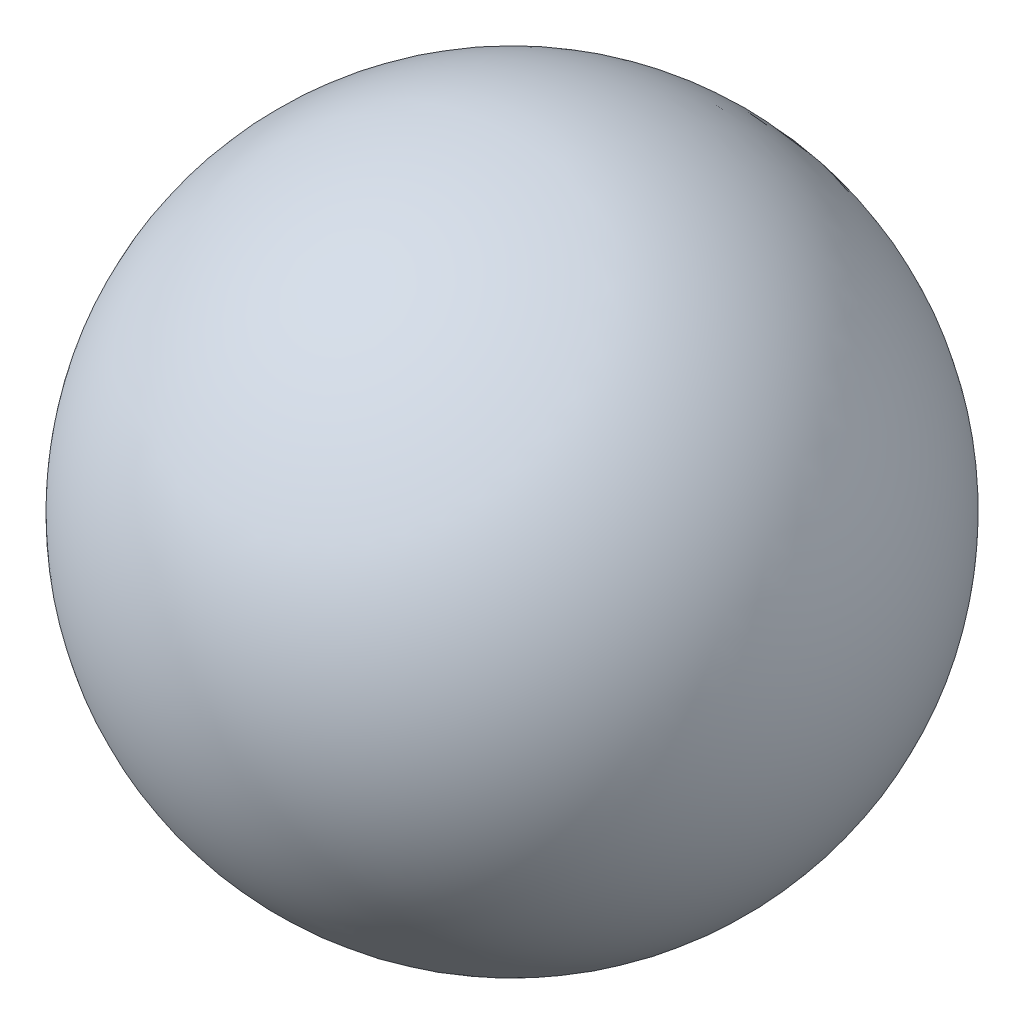
ISO-10303-21;
HEADER;
FILE_DESCRIPTION(('STEP AP214'),'2;1');
FILE_NAME('part.step','',(''),(''),'','','');
FILE_SCHEMA(('AUTOMOTIVE_DESIGN { 1 0 10303 214 1 1 1 1 }'));
ENDSEC;
DATA;
#1=APPLICATION_CONTEXT('core data for automotive mechanical design processes');
#2=APPLICATION_PROTOCOL_DEFINITION('international standard','automotive_design',2000,#1);
#3=PRODUCT_CONTEXT('',#1,'mechanical');
#4=PRODUCT('Part','Part','',(#3));
#5=PRODUCT_RELATED_PRODUCT_CATEGORY('part','',(#4));
#6=PRODUCT_DEFINITION_FORMATION('','',#4);
#7=PRODUCT_DEFINITION_CONTEXT('part definition',#1,'design');
#8=PRODUCT_DEFINITION('design','',#6,#7);
#9=PRODUCT_DEFINITION_SHAPE('','',#8);
#10=(LENGTH_UNIT() NAMED_UNIT(*) SI_UNIT(.MILLI.,.METRE.));
#11=(NAMED_UNIT(*) PLANE_ANGLE_UNIT() SI_UNIT($,.RADIAN.));
#12=(NAMED_UNIT(*) SI_UNIT($,.STERADIAN.) SOLID_ANGLE_UNIT());
#13=UNCERTAINTY_MEASURE_WITH_UNIT(LENGTH_MEASURE(1.E-05),#10,'distance_accuracy_value','');
#14=(GEOMETRIC_REPRESENTATION_CONTEXT(3) GLOBAL_UNCERTAINTY_ASSIGNED_CONTEXT((#13)) GLOBAL_UNIT_ASSIGNED_CONTEXT((#10,
#11,#12)) REPRESENTATION_CONTEXT('',''));
#15=CARTESIAN_POINT('',(0.,0.,0.));
#16=DIRECTION('',(0.,0.,1.));
#17=DIRECTION('',(1.,0.,0.));
#18=AXIS2_PLACEMENT_3D('',#15,#16,#17);
#19=CARTESIAN_POINT('',(67.76,-35.5134126233448,-59.564026728337));
#20=DIRECTION('',(0.,-0.512108044606437,-0.85892103865802));
#21=DIRECTION('',(0.173648177666933,0.845872098095716,-0.504327972708341));
#22=AXIS2_PLACEMENT_3D('',#19,#20,#21);
#23=SPHERICAL_SURFACE('',#22,7.15);
#24=CARTESIAN_POINT('',(67.76,-39.1749851422808,-65.7053121547418));
#25=VERTEX_POINT('',#24);
#26=VERTEX_LOOP('',#25);
#27=FACE_BOUND('',#26,.T.);
#28=CARTESIAN_POINT('',(67.76,-31.8518401044088,-53.4227413019322));
#29=VERTEX_POINT('',#28);
#30=VERTEX_LOOP('',#29);
#31=FACE_BOUND('',#30,.T.);
#32=ADVANCED_FACE('F16',(#27,#31),#23,.T.);
#33=CLOSED_SHELL('',(#32));
#34=MANIFOLD_SOLID_BREP('B1',#33);
#35=ADVANCED_BREP_SHAPE_REPRESENTATION('',(#18,#34),#14);
#36=SHAPE_DEFINITION_REPRESENTATION(#9,#35);
ENDSEC;
END-ISO-10303-21;
